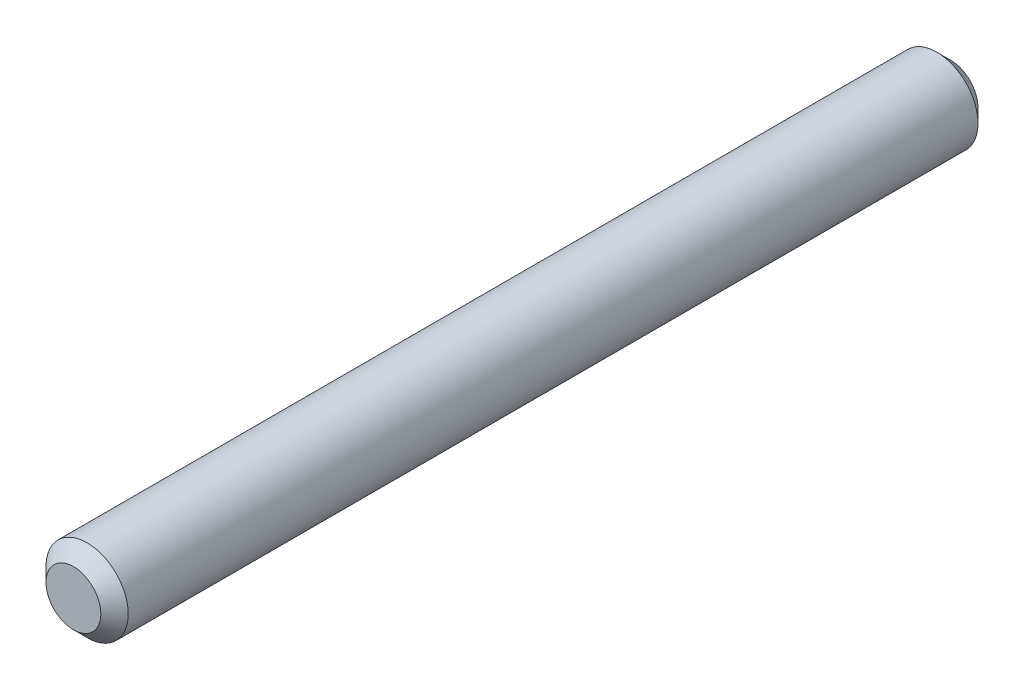
ISO-10303-21;
HEADER;
FILE_DESCRIPTION(('STEP AP214'),'2;1');
FILE_NAME('part.step','',(''),(''),'','','');
FILE_SCHEMA(('AUTOMOTIVE_DESIGN { 1 0 10303 214 1 1 1 1 }'));
ENDSEC;
DATA;
#1=APPLICATION_CONTEXT('core data for automotive mechanical design processes');
#2=APPLICATION_PROTOCOL_DEFINITION('international standard','automotive_design',2000,#1);
#3=PRODUCT_CONTEXT('',#1,'mechanical');
#4=PRODUCT('Part','Part','',(#3));
#5=PRODUCT_RELATED_PRODUCT_CATEGORY('part','',(#4));
#6=PRODUCT_DEFINITION_FORMATION('','',#4);
#7=PRODUCT_DEFINITION_CONTEXT('part definition',#1,'design');
#8=PRODUCT_DEFINITION('design','',#6,#7);
#9=PRODUCT_DEFINITION_SHAPE('','',#8);
#10=(LENGTH_UNIT() NAMED_UNIT(*) SI_UNIT(.MILLI.,.METRE.));
#11=(NAMED_UNIT(*) PLANE_ANGLE_UNIT() SI_UNIT($,.RADIAN.));
#12=(NAMED_UNIT(*) SI_UNIT($,.STERADIAN.) SOLID_ANGLE_UNIT());
#13=UNCERTAINTY_MEASURE_WITH_UNIT(LENGTH_MEASURE(1.E-05),#10,'distance_accuracy_value','');
#14=(GEOMETRIC_REPRESENTATION_CONTEXT(3) GLOBAL_UNCERTAINTY_ASSIGNED_CONTEXT((#13)) GLOBAL_UNIT_ASSIGNED_CONTEXT((#10,
#11,#12)) REPRESENTATION_CONTEXT('',''));
#15=CARTESIAN_POINT('',(0.,0.,0.));
#16=DIRECTION('',(0.,0.,1.));
#17=DIRECTION('',(1.,0.,0.));
#18=AXIS2_PLACEMENT_3D('',#15,#16,#17);
#19=CARTESIAN_POINT('',(0.,0.,16.));
#20=DIRECTION('',(0.,0.,-1.));
#21=DIRECTION('',(-1.,0.,0.));
#22=AXIS2_PLACEMENT_3D('',#19,#20,#21);
#23=CYLINDRICAL_SURFACE('',#22,0.75);
#24=CARTESIAN_POINT('',(0.,0.,15.75));
#25=DIRECTION('',(0.,0.,1.));
#26=DIRECTION('',(1.,0.,0.));
#27=AXIS2_PLACEMENT_3D('',#24,#25,#26);
#28=CIRCLE('',#27,0.75);
#29=CARTESIAN_POINT('',(0.75,0.,15.75));
#30=VERTEX_POINT('',#29);
#31=EDGE_CURVE('E38',#30,#30,#28,.F.);
#32=ORIENTED_EDGE('',*,*,#31,.T.);
#33=EDGE_LOOP('',(#32));
#34=FACE_BOUND('',#33,.T.);
#35=CARTESIAN_POINT('',(0.,0.,0.250000000000004));
#36=DIRECTION('',(0.,0.,1.));
#37=DIRECTION('',(1.,0.,0.));
#38=AXIS2_PLACEMENT_3D('',#35,#36,#37);
#39=CIRCLE('',#38,0.75);
#40=CARTESIAN_POINT('',(0.75,0.,0.250000000000004));
#41=VERTEX_POINT('',#40);
#42=EDGE_CURVE('E42',#41,#41,#39,.T.);
#43=ORIENTED_EDGE('',*,*,#42,.T.);
#44=EDGE_LOOP('',(#43));
#45=FACE_BOUND('',#44,.T.);
#46=ADVANCED_FACE('F31',(#34,#45),#23,.T.);
#47=CARTESIAN_POINT('',(0.,0.,16.));
#48=DIRECTION('',(0.,0.,1.));
#49=DIRECTION('',(1.,0.,0.));
#50=AXIS2_PLACEMENT_3D('',#47,#48,#49);
#51=PLANE('',#50);
#52=CARTESIAN_POINT('',(0.,0.,16.));
#53=DIRECTION('',(0.,0.,1.));
#54=DIRECTION('',(1.,0.,0.));
#55=AXIS2_PLACEMENT_3D('',#52,#53,#54);
#56=CIRCLE('',#55,0.5);
#57=CARTESIAN_POINT('',(0.5,0.,16.));
#58=VERTEX_POINT('',#57);
#59=EDGE_CURVE('E46',#58,#58,#56,.T.);
#60=ORIENTED_EDGE('',*,*,#59,.T.);
#61=EDGE_LOOP('',(#60));
#62=FACE_BOUND('',#61,.T.);
#63=ADVANCED_FACE('F52',(#62),#51,.T.);
#64=CARTESIAN_POINT('',(0.,0.,0.));
#65=DIRECTION('',(0.,0.,1.));
#66=DIRECTION('',(1.,0.,0.));
#67=AXIS2_PLACEMENT_3D('',#64,#65,#66);
#68=PLANE('',#67);
#69=CARTESIAN_POINT('',(0.,0.,0.));
#70=DIRECTION('',(0.,0.,1.));
#71=DIRECTION('',(1.,0.,0.));
#72=AXIS2_PLACEMENT_3D('',#69,#70,#71);
#73=CIRCLE('',#72,0.499999999999997);
#74=CARTESIAN_POINT('',(0.499999999999997,0.,0.));
#75=VERTEX_POINT('',#74);
#76=EDGE_CURVE('E10',#75,#75,#73,.F.);
#77=ORIENTED_EDGE('',*,*,#76,.T.);
#78=EDGE_LOOP('',(#77));
#79=FACE_BOUND('',#78,.T.);
#80=ADVANCED_FACE('F56',(#79),#68,.F.);
#81=CARTESIAN_POINT('',(0.,0.,16.));
#82=DIRECTION('',(0.,0.,-1.));
#83=DIRECTION('',(-1.,0.,0.));
#84=AXIS2_PLACEMENT_3D('',#81,#82,#83);
#85=CONICAL_SURFACE('',#84,0.5,0.78539816339744);
#86=ORIENTED_EDGE('',*,*,#31,.F.);
#87=EDGE_LOOP('',(#86));
#88=FACE_BOUND('',#87,.T.);
#89=ORIENTED_EDGE('',*,*,#59,.F.);
#90=EDGE_LOOP('',(#89));
#91=FACE_BOUND('',#90,.T.);
#92=ADVANCED_FACE('F54',(#88,#91),#85,.T.);
#93=CARTESIAN_POINT('',(0.,0.,0.250000000000004));
#94=DIRECTION('',(0.,0.,1.));
#95=DIRECTION('',(1.,0.,0.));
#96=AXIS2_PLACEMENT_3D('',#93,#94,#95);
#97=CONICAL_SURFACE('',#96,0.75,0.785398163397447);
#98=ORIENTED_EDGE('',*,*,#76,.F.);
#99=EDGE_LOOP('',(#98));
#100=FACE_BOUND('',#99,.T.);
#101=ORIENTED_EDGE('',*,*,#42,.F.);
#102=EDGE_LOOP('',(#101));
#103=FACE_BOUND('',#102,.T.);
#104=ADVANCED_FACE('F33',(#100,#103),#97,.T.);
#105=CLOSED_SHELL('',(#46,#63,#80,#92,#104));
#106=MANIFOLD_SOLID_BREP('B2',#105);
#107=ADVANCED_BREP_SHAPE_REPRESENTATION('',(#18,#106),#14);
#108=SHAPE_DEFINITION_REPRESENTATION(#9,#107);
ENDSEC;
END-ISO-10303-21;
